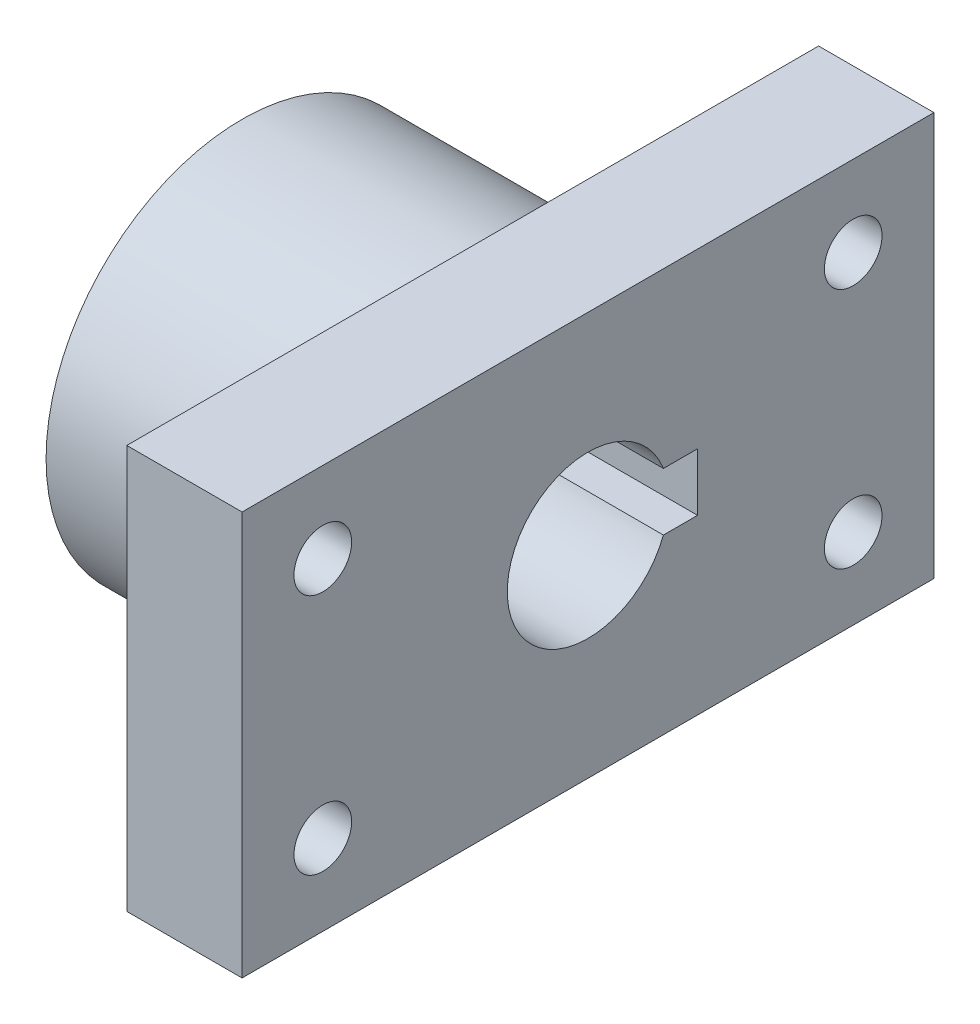
ISO-10303-21;
HEADER;
FILE_DESCRIPTION(('STEP AP214'),'2;1');
FILE_NAME('part.step','',(''),(''),'','','');
FILE_SCHEMA(('AUTOMOTIVE_DESIGN { 1 0 10303 214 1 1 1 1 }'));
ENDSEC;
DATA;
#1=APPLICATION_CONTEXT('core data for automotive mechanical design processes');
#2=APPLICATION_PROTOCOL_DEFINITION('international standard','automotive_design',2000,#1);
#3=PRODUCT_CONTEXT('',#1,'mechanical');
#4=PRODUCT('Part','Part','',(#3));
#5=PRODUCT_RELATED_PRODUCT_CATEGORY('part','',(#4));
#6=PRODUCT_DEFINITION_FORMATION('','',#4);
#7=PRODUCT_DEFINITION_CONTEXT('part definition',#1,'design');
#8=PRODUCT_DEFINITION('design','',#6,#7);
#9=PRODUCT_DEFINITION_SHAPE('','',#8);
#10=(LENGTH_UNIT() NAMED_UNIT(*) SI_UNIT(.MILLI.,.METRE.));
#11=(NAMED_UNIT(*) PLANE_ANGLE_UNIT() SI_UNIT($,.RADIAN.));
#12=(NAMED_UNIT(*) SI_UNIT($,.STERADIAN.) SOLID_ANGLE_UNIT());
#13=UNCERTAINTY_MEASURE_WITH_UNIT(LENGTH_MEASURE(1.E-05),#10,'distance_accuracy_value','');
#14=(GEOMETRIC_REPRESENTATION_CONTEXT(3) GLOBAL_UNCERTAINTY_ASSIGNED_CONTEXT((#13)) GLOBAL_UNIT_ASSIGNED_CONTEXT((#10,
#11,#12)) REPRESENTATION_CONTEXT('',''));
#15=CARTESIAN_POINT('',(0.,0.,0.));
#16=DIRECTION('',(0.,0.,1.));
#17=DIRECTION('',(1.,0.,0.));
#18=AXIS2_PLACEMENT_3D('',#15,#16,#17);
#19=CARTESIAN_POINT('',(0.,0.,0.));
#20=DIRECTION('',(1.,0.,0.));
#21=DIRECTION('',(0.,0.,-1.));
#22=AXIS2_PLACEMENT_3D('',#19,#20,#21);
#23=PLANE('',#22);
#24=DIRECTION('',(0.,0.,-1.));
#25=VECTOR('',#24,1.);
#26=CARTESIAN_POINT('',(0.,2.5,0.));
#27=LINE('',#26,#25);
#28=CARTESIAN_POINT('',(0.,2.5,-6.53834841531101));
#29=VERTEX_POINT('',#28);
#30=CARTESIAN_POINT('',(0.,2.5,-9.5));
#31=VERTEX_POINT('',#30);
#32=EDGE_CURVE('E211',#29,#31,#27,.T.);
#33=ORIENTED_EDGE('',*,*,#32,.F.);
#34=CARTESIAN_POINT('',(0.,0.,0.));
#35=DIRECTION('',(1.,0.,0.));
#36=DIRECTION('',(0.,0.,-1.));
#37=AXIS2_PLACEMENT_3D('',#34,#35,#36);
#38=CIRCLE('',#37,7.);
#39=CARTESIAN_POINT('',(0.,-2.5,-6.53834841531101));
#40=VERTEX_POINT('',#39);
#41=EDGE_CURVE('E199',#29,#40,#38,.T.);
#42=ORIENTED_EDGE('',*,*,#41,.T.);
#43=DIRECTION('',(0.,0.,-1.));
#44=VECTOR('',#43,1.);
#45=CARTESIAN_POINT('',(0.,-2.5,0.));
#46=LINE('',#45,#44);
#47=CARTESIAN_POINT('',(0.,-2.5,-9.5));
#48=VERTEX_POINT('',#47);
#49=EDGE_CURVE('E202',#40,#48,#46,.T.);
#50=ORIENTED_EDGE('',*,*,#49,.T.);
#51=DIRECTION('',(0.,1.,0.));
#52=VECTOR('',#51,1.);
#53=CARTESIAN_POINT('',(0.,0.,-9.5));
#54=LINE('',#53,#52);
#55=EDGE_CURVE('E207',#48,#31,#54,.T.);
#56=ORIENTED_EDGE('',*,*,#55,.T.);
#57=EDGE_LOOP('',(#33,#42,#50,#56));
#58=FACE_BOUND('',#57,.T.);
#59=CARTESIAN_POINT('',(0.,0.,0.));
#60=DIRECTION('',(-1.,0.,0.));
#61=DIRECTION('',(0.,0.,1.));
#62=AXIS2_PLACEMENT_3D('',#59,#60,#61);
#63=CIRCLE('',#62,17.);
#64=CARTESIAN_POINT('',(0.,0.,17.));
#65=VERTEX_POINT('',#64);
#66=EDGE_CURVE('E114',#65,#65,#63,.T.);
#67=ORIENTED_EDGE('',*,*,#66,.T.);
#68=EDGE_LOOP('',(#67));
#69=FACE_BOUND('',#68,.T.);
#70=ADVANCED_FACE('F40',(#58,#69),#23,.F.);
#71=CARTESIAN_POINT('',(30.,0.,0.));
#72=DIRECTION('',(1.,0.,0.));
#73=DIRECTION('',(0.,0.,-1.));
#74=AXIS2_PLACEMENT_3D('',#71,#72,#73);
#75=PLANE('',#74);
#76=DIRECTION('',(0.,-1.,0.));
#77=VECTOR('',#76,1.);
#78=CARTESIAN_POINT('',(30.,-17.5,30.));
#79=LINE('',#78,#77);
#80=CARTESIAN_POINT('',(30.,17.5,30.));
#81=VERTEX_POINT('',#80);
#82=CARTESIAN_POINT('',(30.,-17.5,30.));
#83=VERTEX_POINT('',#82);
#84=EDGE_CURVE('E132',#81,#83,#79,.T.);
#85=ORIENTED_EDGE('',*,*,#84,.T.);
#86=DIRECTION('',(0.,0.,-1.));
#87=VECTOR('',#86,1.);
#88=CARTESIAN_POINT('',(30.,-17.5,-30.));
#89=LINE('',#88,#87);
#90=CARTESIAN_POINT('',(30.,-17.5,-30.));
#91=VERTEX_POINT('',#90);
#92=EDGE_CURVE('E126',#83,#91,#89,.T.);
#93=ORIENTED_EDGE('',*,*,#92,.T.);
#94=DIRECTION('',(0.,1.,0.));
#95=VECTOR('',#94,1.);
#96=CARTESIAN_POINT('',(30.,-17.5,-30.));
#97=LINE('',#96,#95);
#98=CARTESIAN_POINT('',(30.,17.5,-30.));
#99=VERTEX_POINT('',#98);
#100=EDGE_CURVE('E131',#91,#99,#97,.T.);
#101=ORIENTED_EDGE('',*,*,#100,.T.);
#102=DIRECTION('',(0.,0.,1.));
#103=VECTOR('',#102,1.);
#104=CARTESIAN_POINT('',(30.,17.5,-30.));
#105=LINE('',#104,#103);
#106=EDGE_CURVE('E137',#99,#81,#105,.T.);
#107=ORIENTED_EDGE('',*,*,#106,.T.);
#108=EDGE_LOOP('',(#85,#93,#101,#107));
#109=FACE_BOUND('',#108,.T.);
#110=CARTESIAN_POINT('',(30.,0.,0.));
#111=DIRECTION('',(1.,0.,0.));
#112=DIRECTION('',(0.,0.,-1.));
#113=AXIS2_PLACEMENT_3D('',#110,#111,#112);
#114=CIRCLE('',#113,7.);
#115=CARTESIAN_POINT('',(30.,2.5,-6.53834841531101));
#116=VERTEX_POINT('',#115);
#117=CARTESIAN_POINT('',(30.,-2.5,-6.53834841531101));
#118=VERTEX_POINT('',#117);
#119=EDGE_CURVE('E65',#116,#118,#114,.T.);
#120=ORIENTED_EDGE('',*,*,#119,.F.);
#121=DIRECTION('',(0.,0.,-1.));
#122=VECTOR('',#121,1.);
#123=CARTESIAN_POINT('',(30.,2.5,0.));
#124=LINE('',#123,#122);
#125=CARTESIAN_POINT('',(30.,2.5,-9.5));
#126=VERTEX_POINT('',#125);
#127=EDGE_CURVE('E203',#116,#126,#124,.T.);
#128=ORIENTED_EDGE('',*,*,#127,.T.);
#129=DIRECTION('',(0.,1.,0.));
#130=VECTOR('',#129,1.);
#131=CARTESIAN_POINT('',(30.,0.,-9.5));
#132=LINE('',#131,#130);
#133=CARTESIAN_POINT('',(30.,-2.5,-9.5));
#134=VERTEX_POINT('',#133);
#135=EDGE_CURVE('E220',#134,#126,#132,.T.);
#136=ORIENTED_EDGE('',*,*,#135,.F.);
#137=DIRECTION('',(0.,0.,-1.));
#138=VECTOR('',#137,1.);
#139=CARTESIAN_POINT('',(30.,-2.5,0.));
#140=LINE('',#139,#138);
#141=EDGE_CURVE('E216',#118,#134,#140,.T.);
#142=ORIENTED_EDGE('',*,*,#141,.F.);
#143=EDGE_LOOP('',(#120,#128,#136,#142));
#144=FACE_BOUND('',#143,.T.);
#145=CARTESIAN_POINT('',(30.,-10.5,-23.));
#146=DIRECTION('',(-1.,0.,0.));
#147=DIRECTION('',(0.,0.,1.));
#148=AXIS2_PLACEMENT_3D('',#145,#146,#147);
#149=CIRCLE('',#148,2.49999999999999);
#150=CARTESIAN_POINT('',(30.,-10.5,-20.5));
#151=VERTEX_POINT('',#150);
#152=EDGE_CURVE('E195',#151,#151,#149,.T.);
#153=ORIENTED_EDGE('',*,*,#152,.T.);
#154=EDGE_LOOP('',(#153));
#155=FACE_BOUND('',#154,.T.);
#156=CARTESIAN_POINT('',(30.,10.5,-23.));
#157=DIRECTION('',(-1.,0.,0.));
#158=DIRECTION('',(0.,0.,1.));
#159=AXIS2_PLACEMENT_3D('',#156,#157,#158);
#160=CIRCLE('',#159,2.49999999999999);
#161=CARTESIAN_POINT('',(30.,10.5,-20.5));
#162=VERTEX_POINT('',#161);
#163=EDGE_CURVE('E191',#162,#162,#160,.T.);
#164=ORIENTED_EDGE('',*,*,#163,.T.);
#165=EDGE_LOOP('',(#164));
#166=FACE_BOUND('',#165,.T.);
#167=CARTESIAN_POINT('',(30.,-10.5,23.));
#168=DIRECTION('',(-1.,0.,0.));
#169=DIRECTION('',(0.,0.,1.));
#170=AXIS2_PLACEMENT_3D('',#167,#168,#169);
#171=CIRCLE('',#170,2.49999999999999);
#172=CARTESIAN_POINT('',(30.,-10.5,25.5));
#173=VERTEX_POINT('',#172);
#174=EDGE_CURVE('E187',#173,#173,#171,.T.);
#175=ORIENTED_EDGE('',*,*,#174,.T.);
#176=EDGE_LOOP('',(#175));
#177=FACE_BOUND('',#176,.T.);
#178=CARTESIAN_POINT('',(30.,10.5,23.));
#179=DIRECTION('',(-1.,0.,0.));
#180=DIRECTION('',(0.,0.,1.));
#181=AXIS2_PLACEMENT_3D('',#178,#179,#180);
#182=CIRCLE('',#181,2.49999999999999);
#183=CARTESIAN_POINT('',(30.,10.5,25.5));
#184=VERTEX_POINT('',#183);
#185=EDGE_CURVE('E184',#184,#184,#182,.T.);
#186=ORIENTED_EDGE('',*,*,#185,.T.);
#187=EDGE_LOOP('',(#186));
#188=FACE_BOUND('',#187,.T.);
#189=ADVANCED_FACE('F134',(#109,#144,#155,#166,#177,#188),#75,.T.);
#190=CARTESIAN_POINT('',(30.,-17.5,30.));
#191=DIRECTION('',(0.,0.,-1.));
#192=DIRECTION('',(-1.,0.,0.));
#193=AXIS2_PLACEMENT_3D('',#190,#191,#192);
#194=PLANE('',#193);
#195=DIRECTION('',(-1.,0.,0.));
#196=VECTOR('',#195,1.);
#197=CARTESIAN_POINT('',(30.,17.5,30.));
#198=LINE('',#197,#196);
#199=CARTESIAN_POINT('',(20.,17.5,30.));
#200=VERTEX_POINT('',#199);
#201=EDGE_CURVE('E121',#81,#200,#198,.T.);
#202=ORIENTED_EDGE('',*,*,#201,.T.);
#203=DIRECTION('',(0.,1.,0.));
#204=VECTOR('',#203,1.);
#205=CARTESIAN_POINT('',(20.,17.5,30.));
#206=LINE('',#205,#204);
#207=CARTESIAN_POINT('',(20.,-17.5,30.));
#208=VERTEX_POINT('',#207);
#209=EDGE_CURVE('E57',#208,#200,#206,.T.);
#210=ORIENTED_EDGE('',*,*,#209,.F.);
#211=DIRECTION('',(-1.,0.,0.));
#212=VECTOR('',#211,1.);
#213=CARTESIAN_POINT('',(30.,-17.5,30.));
#214=LINE('',#213,#212);
#215=EDGE_CURVE('E12',#83,#208,#214,.T.);
#216=ORIENTED_EDGE('',*,*,#215,.F.);
#217=ORIENTED_EDGE('',*,*,#84,.F.);
#218=EDGE_LOOP('',(#202,#210,#216,#217));
#219=FACE_BOUND('',#218,.T.);
#220=ADVANCED_FACE('F42',(#219),#194,.F.);
#221=CARTESIAN_POINT('',(30.,-17.5,-30.));
#222=DIRECTION('',(0.,1.,0.));
#223=DIRECTION('',(0.,0.,1.));
#224=AXIS2_PLACEMENT_3D('',#221,#222,#223);
#225=PLANE('',#224);
#226=ORIENTED_EDGE('',*,*,#215,.T.);
#227=DIRECTION('',(0.,0.,1.));
#228=VECTOR('',#227,1.);
#229=CARTESIAN_POINT('',(20.,-17.5,-30.));
#230=LINE('',#229,#228);
#231=CARTESIAN_POINT('',(20.,-17.5,-30.));
#232=VERTEX_POINT('',#231);
#233=EDGE_CURVE('E105',#232,#208,#230,.T.);
#234=ORIENTED_EDGE('',*,*,#233,.F.);
#235=DIRECTION('',(-1.,0.,0.));
#236=VECTOR('',#235,1.);
#237=CARTESIAN_POINT('',(30.,-17.5,-30.));
#238=LINE('',#237,#236);
#239=EDGE_CURVE('E50',#91,#232,#238,.T.);
#240=ORIENTED_EDGE('',*,*,#239,.F.);
#241=ORIENTED_EDGE('',*,*,#92,.F.);
#242=EDGE_LOOP('',(#226,#234,#240,#241));
#243=FACE_BOUND('',#242,.T.);
#244=ADVANCED_FACE('F125',(#243),#225,.F.);
#245=CARTESIAN_POINT('',(30.,-17.5,-30.));
#246=DIRECTION('',(0.,0.,1.));
#247=DIRECTION('',(1.,0.,0.));
#248=AXIS2_PLACEMENT_3D('',#245,#246,#247);
#249=PLANE('',#248);
#250=ORIENTED_EDGE('',*,*,#239,.T.);
#251=DIRECTION('',(0.,-1.,0.));
#252=VECTOR('',#251,1.);
#253=CARTESIAN_POINT('',(20.,17.5,-30.));
#254=LINE('',#253,#252);
#255=CARTESIAN_POINT('',(20.,17.5,-30.));
#256=VERTEX_POINT('',#255);
#257=EDGE_CURVE('E109',#256,#232,#254,.T.);
#258=ORIENTED_EDGE('',*,*,#257,.F.);
#259=DIRECTION('',(-1.,0.,0.));
#260=VECTOR('',#259,1.);
#261=CARTESIAN_POINT('',(30.,17.5,-30.));
#262=LINE('',#261,#260);
#263=EDGE_CURVE('E155',#99,#256,#262,.T.);
#264=ORIENTED_EDGE('',*,*,#263,.F.);
#265=ORIENTED_EDGE('',*,*,#100,.F.);
#266=EDGE_LOOP('',(#250,#258,#264,#265));
#267=FACE_BOUND('',#266,.T.);
#268=ADVANCED_FACE('F163',(#267),#249,.F.);
#269=CARTESIAN_POINT('',(30.,17.5,-30.));
#270=DIRECTION('',(0.,-1.,0.));
#271=DIRECTION('',(0.,0.,-1.));
#272=AXIS2_PLACEMENT_3D('',#269,#270,#271);
#273=PLANE('',#272);
#274=ORIENTED_EDGE('',*,*,#263,.T.);
#275=DIRECTION('',(0.,0.,-1.));
#276=VECTOR('',#275,1.);
#277=CARTESIAN_POINT('',(20.,17.5,-30.));
#278=LINE('',#277,#276);
#279=EDGE_CURVE('E123',#200,#256,#278,.T.);
#280=ORIENTED_EDGE('',*,*,#279,.F.);
#281=ORIENTED_EDGE('',*,*,#201,.F.);
#282=ORIENTED_EDGE('',*,*,#106,.F.);
#283=EDGE_LOOP('',(#274,#280,#281,#282));
#284=FACE_BOUND('',#283,.T.);
#285=ADVANCED_FACE('F166',(#284),#273,.F.);
#286=CARTESIAN_POINT('',(0.,0.,0.));
#287=DIRECTION('',(1.,0.,0.));
#288=DIRECTION('',(0.,0.,-1.));
#289=AXIS2_PLACEMENT_3D('',#286,#287,#288);
#290=CYLINDRICAL_SURFACE('',#289,7.);
#291=ORIENTED_EDGE('',*,*,#119,.T.);
#292=DIRECTION('',(1.,0.,0.));
#293=VECTOR('',#292,1.);
#294=CARTESIAN_POINT('',(0.,-2.5,-6.53834841531101));
#295=LINE('',#294,#293);
#296=EDGE_CURVE('E146',#40,#118,#295,.T.);
#297=ORIENTED_EDGE('',*,*,#296,.F.);
#298=ORIENTED_EDGE('',*,*,#41,.F.);
#299=DIRECTION('',(1.,0.,0.));
#300=VECTOR('',#299,1.);
#301=CARTESIAN_POINT('',(0.,2.5,-6.53834841531101));
#302=LINE('',#301,#300);
#303=EDGE_CURVE('E139',#29,#116,#302,.T.);
#304=ORIENTED_EDGE('',*,*,#303,.T.);
#305=EDGE_LOOP('',(#291,#297,#298,#304));
#306=FACE_BOUND('',#305,.T.);
#307=ADVANCED_FACE('F246',(#306),#290,.F.);
#308=CARTESIAN_POINT('',(0.,2.5,0.));
#309=DIRECTION('',(0.,-1.,0.));
#310=DIRECTION('',(0.,0.,-1.));
#311=AXIS2_PLACEMENT_3D('',#308,#309,#310);
#312=PLANE('',#311);
#313=ORIENTED_EDGE('',*,*,#127,.F.);
#314=ORIENTED_EDGE('',*,*,#303,.F.);
#315=ORIENTED_EDGE('',*,*,#32,.T.);
#316=DIRECTION('',(1.,0.,0.));
#317=VECTOR('',#316,1.);
#318=CARTESIAN_POINT('',(0.,2.5,-9.5));
#319=LINE('',#318,#317);
#320=EDGE_CURVE('E143',#31,#126,#319,.T.);
#321=ORIENTED_EDGE('',*,*,#320,.T.);
#322=EDGE_LOOP('',(#313,#314,#315,#321));
#323=FACE_BOUND('',#322,.T.);
#324=ADVANCED_FACE('F247',(#323),#312,.T.);
#325=CARTESIAN_POINT('',(0.,0.,-9.5));
#326=DIRECTION('',(0.,0.,-1.));
#327=DIRECTION('',(-1.,0.,0.));
#328=AXIS2_PLACEMENT_3D('',#325,#326,#327);
#329=PLANE('',#328);
#330=ORIENTED_EDGE('',*,*,#135,.T.);
#331=ORIENTED_EDGE('',*,*,#320,.F.);
#332=ORIENTED_EDGE('',*,*,#55,.F.);
#333=DIRECTION('',(1.,0.,0.));
#334=VECTOR('',#333,1.);
#335=CARTESIAN_POINT('',(0.,-2.5,-9.5));
#336=LINE('',#335,#334);
#337=EDGE_CURVE('E227',#48,#134,#336,.T.);
#338=ORIENTED_EDGE('',*,*,#337,.T.);
#339=EDGE_LOOP('',(#330,#331,#332,#338));
#340=FACE_BOUND('',#339,.T.);
#341=ADVANCED_FACE('F241',(#340),#329,.F.);
#342=CARTESIAN_POINT('',(0.,-2.5,0.));
#343=DIRECTION('',(0.,-1.,0.));
#344=DIRECTION('',(0.,0.,-1.));
#345=AXIS2_PLACEMENT_3D('',#342,#343,#344);
#346=PLANE('',#345);
#347=ORIENTED_EDGE('',*,*,#141,.T.);
#348=ORIENTED_EDGE('',*,*,#337,.F.);
#349=ORIENTED_EDGE('',*,*,#49,.F.);
#350=ORIENTED_EDGE('',*,*,#296,.T.);
#351=EDGE_LOOP('',(#347,#348,#349,#350));
#352=FACE_BOUND('',#351,.T.);
#353=ADVANCED_FACE('F235',(#352),#346,.F.);
#354=CARTESIAN_POINT('',(0.,-10.5,-23.));
#355=DIRECTION('',(-1.,0.,0.));
#356=DIRECTION('',(0.,0.,1.));
#357=AXIS2_PLACEMENT_3D('',#354,#355,#356);
#358=CYLINDRICAL_SURFACE('',#357,2.5);
#359=CARTESIAN_POINT('',(20.,-10.5,-23.));
#360=DIRECTION('',(1.,0.,0.));
#361=DIRECTION('',(0.,0.,-1.));
#362=AXIS2_PLACEMENT_3D('',#359,#360,#361);
#363=CIRCLE('',#362,2.5);
#364=CARTESIAN_POINT('',(20.,-10.5,-25.5));
#365=VERTEX_POINT('',#364);
#366=EDGE_CURVE('E181',#365,#365,#363,.F.);
#367=ORIENTED_EDGE('',*,*,#366,.T.);
#368=EDGE_LOOP('',(#367));
#369=FACE_BOUND('',#368,.T.);
#370=ORIENTED_EDGE('',*,*,#152,.F.);
#371=EDGE_LOOP('',(#370));
#372=FACE_BOUND('',#371,.T.);
#373=ADVANCED_FACE('F311',(#369,#372),#358,.F.);
#374=CARTESIAN_POINT('',(0.,10.5,-23.));
#375=DIRECTION('',(-1.,0.,0.));
#376=DIRECTION('',(0.,0.,1.));
#377=AXIS2_PLACEMENT_3D('',#374,#375,#376);
#378=CYLINDRICAL_SURFACE('',#377,2.5);
#379=CARTESIAN_POINT('',(20.,10.5,-23.));
#380=DIRECTION('',(1.,0.,0.));
#381=DIRECTION('',(0.,0.,-1.));
#382=AXIS2_PLACEMENT_3D('',#379,#380,#381);
#383=CIRCLE('',#382,2.5);
#384=CARTESIAN_POINT('',(20.,10.5,-25.5));
#385=VERTEX_POINT('',#384);
#386=EDGE_CURVE('E177',#385,#385,#383,.F.);
#387=ORIENTED_EDGE('',*,*,#386,.T.);
#388=EDGE_LOOP('',(#387));
#389=FACE_BOUND('',#388,.T.);
#390=ORIENTED_EDGE('',*,*,#163,.F.);
#391=EDGE_LOOP('',(#390));
#392=FACE_BOUND('',#391,.T.);
#393=ADVANCED_FACE('F317',(#389,#392),#378,.F.);
#394=CARTESIAN_POINT('',(0.,-10.5,23.));
#395=DIRECTION('',(-1.,0.,0.));
#396=DIRECTION('',(0.,0.,1.));
#397=AXIS2_PLACEMENT_3D('',#394,#395,#396);
#398=CYLINDRICAL_SURFACE('',#397,2.5);
#399=CARTESIAN_POINT('',(20.,-10.5,23.));
#400=DIRECTION('',(1.,0.,0.));
#401=DIRECTION('',(0.,0.,-1.));
#402=AXIS2_PLACEMENT_3D('',#399,#400,#401);
#403=CIRCLE('',#402,2.5);
#404=CARTESIAN_POINT('',(20.,-10.5,20.5));
#405=VERTEX_POINT('',#404);
#406=EDGE_CURVE('E174',#405,#405,#403,.F.);
#407=ORIENTED_EDGE('',*,*,#406,.T.);
#408=EDGE_LOOP('',(#407));
#409=FACE_BOUND('',#408,.T.);
#410=ORIENTED_EDGE('',*,*,#174,.F.);
#411=EDGE_LOOP('',(#410));
#412=FACE_BOUND('',#411,.T.);
#413=ADVANCED_FACE('F328',(#409,#412),#398,.F.);
#414=CARTESIAN_POINT('',(0.,10.5,23.));
#415=DIRECTION('',(-1.,0.,0.));
#416=DIRECTION('',(0.,0.,1.));
#417=AXIS2_PLACEMENT_3D('',#414,#415,#416);
#418=CYLINDRICAL_SURFACE('',#417,2.5);
#419=CARTESIAN_POINT('',(20.,10.5,23.));
#420=DIRECTION('',(1.,0.,0.));
#421=DIRECTION('',(0.,0.,-1.));
#422=AXIS2_PLACEMENT_3D('',#419,#420,#421);
#423=CIRCLE('',#422,2.5);
#424=CARTESIAN_POINT('',(20.,10.5,20.5));
#425=VERTEX_POINT('',#424);
#426=EDGE_CURVE('E44',#425,#425,#423,.F.);
#427=ORIENTED_EDGE('',*,*,#426,.T.);
#428=EDGE_LOOP('',(#427));
#429=FACE_BOUND('',#428,.T.);
#430=ORIENTED_EDGE('',*,*,#185,.F.);
#431=EDGE_LOOP('',(#430));
#432=FACE_BOUND('',#431,.T.);
#433=ADVANCED_FACE('F338',(#429,#432),#418,.F.);
#434=CARTESIAN_POINT('',(20.,0.,0.));
#435=DIRECTION('',(1.,0.,0.));
#436=DIRECTION('',(0.,0.,-1.));
#437=AXIS2_PLACEMENT_3D('',#434,#435,#436);
#438=PLANE('',#437);
#439=ORIENTED_EDGE('',*,*,#386,.F.);
#440=EDGE_LOOP('',(#439));
#441=FACE_BOUND('',#440,.T.);
#442=ORIENTED_EDGE('',*,*,#426,.F.);
#443=EDGE_LOOP('',(#442));
#444=FACE_BOUND('',#443,.T.);
#445=ORIENTED_EDGE('',*,*,#257,.T.);
#446=ORIENTED_EDGE('',*,*,#233,.T.);
#447=ORIENTED_EDGE('',*,*,#209,.T.);
#448=ORIENTED_EDGE('',*,*,#279,.T.);
#449=EDGE_LOOP('',(#445,#446,#447,#448));
#450=FACE_BOUND('',#449,.T.);
#451=CARTESIAN_POINT('',(20.,0.,0.));
#452=DIRECTION('',(1.,0.,0.));
#453=DIRECTION('',(0.,0.,-1.));
#454=AXIS2_PLACEMENT_3D('',#451,#452,#453);
#455=CIRCLE('',#454,17.);
#456=CARTESIAN_POINT('',(20.,0.,-17.));
#457=VERTEX_POINT('',#456);
#458=EDGE_CURVE('E404',#457,#457,#455,.F.);
#459=ORIENTED_EDGE('',*,*,#458,.F.);
#460=EDGE_LOOP('',(#459));
#461=FACE_BOUND('',#460,.T.);
#462=ORIENTED_EDGE('',*,*,#406,.F.);
#463=EDGE_LOOP('',(#462));
#464=FACE_BOUND('',#463,.T.);
#465=ORIENTED_EDGE('',*,*,#366,.F.);
#466=EDGE_LOOP('',(#465));
#467=FACE_BOUND('',#466,.T.);
#468=ADVANCED_FACE('F106',(#441,#444,#450,#461,#464,#467),#438,.F.);
#469=CARTESIAN_POINT('',(99.462219947249,0.,0.));
#470=DIRECTION('',(-1.,0.,0.));
#471=DIRECTION('',(0.,0.,1.));
#472=AXIS2_PLACEMENT_3D('',#469,#470,#471);
#473=CYLINDRICAL_SURFACE('',#472,17.);
#474=ORIENTED_EDGE('',*,*,#66,.F.);
#475=EDGE_LOOP('',(#474));
#476=FACE_BOUND('',#475,.T.);
#477=ORIENTED_EDGE('',*,*,#458,.T.);
#478=EDGE_LOOP('',(#477));
#479=FACE_BOUND('',#478,.T.);
#480=ADVANCED_FACE('F355',(#476,#479),#473,.T.);
#481=CLOSED_SHELL('',(#70,#189,#220,#244,#268,#285,#307,#324,#341,#353,#373,#393,#413,#433,#468,#480));
#482=MANIFOLD_SOLID_BREP('B2',#481);
#483=ADVANCED_BREP_SHAPE_REPRESENTATION('',(#18,#482),#14);
#484=SHAPE_DEFINITION_REPRESENTATION(#9,#483);
ENDSEC;
END-ISO-10303-21;
